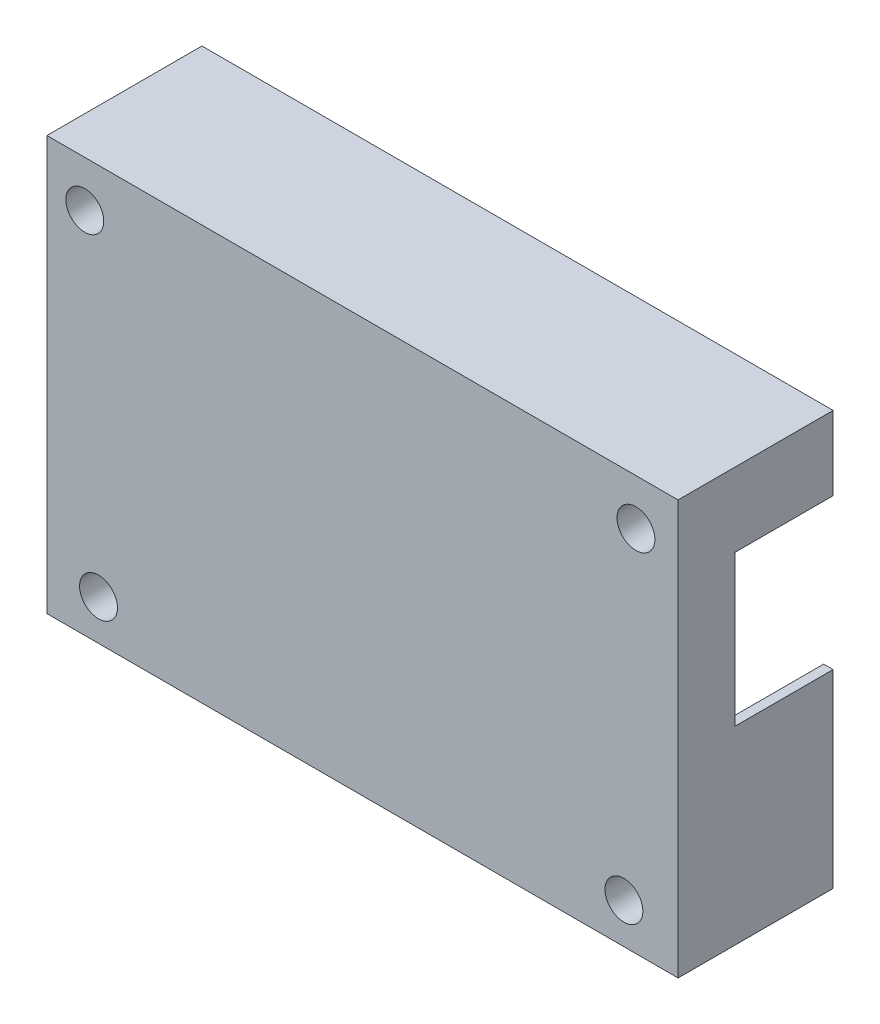
ISO-10303-21;
HEADER;
FILE_DESCRIPTION(('STEP AP214'),'2;1');
FILE_NAME('part.step','',(''),(''),'','','');
FILE_SCHEMA(('AUTOMOTIVE_DESIGN { 1 0 10303 214 1 1 1 1 }'));
ENDSEC;
DATA;
#1=APPLICATION_CONTEXT('core data for automotive mechanical design processes');
#2=APPLICATION_PROTOCOL_DEFINITION('international standard','automotive_design',2000,#1);
#3=PRODUCT_CONTEXT('',#1,'mechanical');
#4=PRODUCT('Part','Part','',(#3));
#5=PRODUCT_RELATED_PRODUCT_CATEGORY('part','',(#4));
#6=PRODUCT_DEFINITION_FORMATION('','',#4);
#7=PRODUCT_DEFINITION_CONTEXT('part definition',#1,'design');
#8=PRODUCT_DEFINITION('design','',#6,#7);
#9=PRODUCT_DEFINITION_SHAPE('','',#8);
#10=(LENGTH_UNIT() NAMED_UNIT(*) SI_UNIT(.MILLI.,.METRE.));
#11=(NAMED_UNIT(*) PLANE_ANGLE_UNIT() SI_UNIT($,.RADIAN.));
#12=(NAMED_UNIT(*) SI_UNIT($,.STERADIAN.) SOLID_ANGLE_UNIT());
#13=UNCERTAINTY_MEASURE_WITH_UNIT(LENGTH_MEASURE(1.E-05),#10,'distance_accuracy_value','');
#14=(GEOMETRIC_REPRESENTATION_CONTEXT(3) GLOBAL_UNCERTAINTY_ASSIGNED_CONTEXT((#13)) GLOBAL_UNIT_ASSIGNED_CONTEXT((#10,
#11,#12)) REPRESENTATION_CONTEXT('',''));
#15=CARTESIAN_POINT('',(0.,0.,0.));
#16=DIRECTION('',(0.,0.,1.));
#17=DIRECTION('',(1.,0.,0.));
#18=AXIS2_PLACEMENT_3D('',#15,#16,#17);
#19=CARTESIAN_POINT('',(0.,0.,8.25));
#20=DIRECTION('',(0.,0.,1.));
#21=DIRECTION('',(1.,0.,0.));
#22=AXIS2_PLACEMENT_3D('',#19,#20,#21);
#23=PLANE('',#22);
#24=DIRECTION('',(1.,0.,0.));
#25=VECTOR('',#24,1.);
#26=CARTESIAN_POINT('',(0.,-1.84,8.25000000000001));
#27=LINE('',#26,#25);
#28=CARTESIAN_POINT('',(-33.325,-1.84,8.25000000000001));
#29=VERTEX_POINT('',#28);
#30=CARTESIAN_POINT('',(-32.325,-1.84,8.25000000000001));
#31=VERTEX_POINT('',#30);
#32=EDGE_CURVE('E597',#29,#31,#27,.T.);
#33=ORIENTED_EDGE('',*,*,#32,.F.);
#34=DIRECTION('',(0.,-1.,0.));
#35=VECTOR('',#34,1.);
#36=CARTESIAN_POINT('',(-33.325,0.,8.25));
#37=LINE('',#36,#35);
#38=CARTESIAN_POINT('',(-33.325,14.06,8.25000000000001));
#39=VERTEX_POINT('',#38);
#40=EDGE_CURVE('E650',#39,#29,#37,.T.);
#41=ORIENTED_EDGE('',*,*,#40,.F.);
#42=DIRECTION('',(-1.,0.,0.));
#43=VECTOR('',#42,1.);
#44=CARTESIAN_POINT('',(0.,14.06,8.25000000000001));
#45=LINE('',#44,#43);
#46=CARTESIAN_POINT('',(-32.325,14.06,8.25));
#47=VERTEX_POINT('',#46);
#48=EDGE_CURVE('E736',#47,#39,#45,.T.);
#49=ORIENTED_EDGE('',*,*,#48,.F.);
#50=DIRECTION('',(0.,-1.,0.));
#51=VECTOR('',#50,1.);
#52=CARTESIAN_POINT('',(-32.325,0.,8.25));
#53=LINE('',#52,#51);
#54=EDGE_CURVE('E615',#47,#31,#53,.T.);
#55=ORIENTED_EDGE('',*,*,#54,.T.);
#56=EDGE_LOOP('',(#33,#41,#49,#55));
#57=FACE_BOUND('',#56,.T.);
#58=ADVANCED_FACE('F303',(#57),#23,.F.);
#59=DIRECTION('',(1.,0.,0.));
#60=VECTOR('',#59,1.);
#61=CARTESIAN_POINT('',(0.,-1.84,8.25000000000001));
#62=LINE('',#61,#60);
#63=CARTESIAN_POINT('',(32.325,-1.84,8.25000000000001));
#64=VERTEX_POINT('',#63);
#65=CARTESIAN_POINT('',(33.325,-1.84,8.25000000000001));
#66=VERTEX_POINT('',#65);
#67=EDGE_CURVE('E603',#64,#66,#62,.T.);
#68=ORIENTED_EDGE('',*,*,#67,.F.);
#69=DIRECTION('',(0.,-1.,0.));
#70=VECTOR('',#69,1.);
#71=CARTESIAN_POINT('',(32.325,0.,8.25));
#72=LINE('',#71,#70);
#73=CARTESIAN_POINT('',(32.325,14.06,8.25));
#74=VERTEX_POINT('',#73);
#75=EDGE_CURVE('E642',#74,#64,#72,.T.);
#76=ORIENTED_EDGE('',*,*,#75,.F.);
#77=DIRECTION('',(-1.,0.,0.));
#78=VECTOR('',#77,1.);
#79=CARTESIAN_POINT('',(0.,14.0600000000002,8.25000000000001));
#80=LINE('',#79,#78);
#81=CARTESIAN_POINT('',(33.325,14.06,8.25));
#82=VERTEX_POINT('',#81);
#83=EDGE_CURVE('E727',#82,#74,#80,.T.);
#84=ORIENTED_EDGE('',*,*,#83,.F.);
#85=DIRECTION('',(0.,1.,0.));
#86=VECTOR('',#85,1.);
#87=CARTESIAN_POINT('',(33.325,0.,8.25));
#88=LINE('',#87,#86);
#89=EDGE_CURVE('E522',#66,#82,#88,.T.);
#90=ORIENTED_EDGE('',*,*,#89,.F.);
#91=EDGE_LOOP('',(#68,#76,#84,#90));
#92=FACE_BOUND('',#91,.T.);
#93=ADVANCED_FACE('F835',(#92),#23,.F.);
#94=CARTESIAN_POINT('',(0.,0.,0.));
#95=DIRECTION('',(0.,0.,1.));
#96=DIRECTION('',(1.,0.,0.));
#97=AXIS2_PLACEMENT_3D('',#94,#95,#96);
#98=PLANE('',#97);
#99=CARTESIAN_POINT('',(-29.325,17.01,0.));
#100=DIRECTION('',(0.,0.,1.));
#101=DIRECTION('',(1.,0.,0.));
#102=AXIS2_PLACEMENT_3D('',#99,#100,#101);
#103=CIRCLE('',#102,2.);
#104=CARTESIAN_POINT('',(-27.325,17.01,0.));
#105=VERTEX_POINT('',#104);
#106=EDGE_CURVE('E714',#105,#105,#103,.T.);
#107=ORIENTED_EDGE('',*,*,#106,.T.);
#108=EDGE_LOOP('',(#107));
#109=FACE_BOUND('',#108,.T.);
#110=DIRECTION('',(0.,1.,0.));
#111=VECTOR('',#110,1.);
#112=CARTESIAN_POINT('',(-26.325,0.,0.));
#113=LINE('',#112,#111);
#114=CARTESIAN_POINT('',(-26.325,15.06,0.));
#115=VERTEX_POINT('',#114);
#116=CARTESIAN_POINT('',(-26.325,20.86,0.));
#117=VERTEX_POINT('',#116);
#118=EDGE_CURVE('E718',#115,#117,#113,.T.);
#119=ORIENTED_EDGE('',*,*,#118,.F.);
#120=CARTESIAN_POINT('',(-27.325,15.06,0.));
#121=DIRECTION('',(0.,0.,1.));
#122=DIRECTION('',(1.,0.,0.));
#123=AXIS2_PLACEMENT_3D('',#120,#121,#122);
#124=CIRCLE('',#123,1.);
#125=CARTESIAN_POINT('',(-27.325,14.06,0.));
#126=VERTEX_POINT('',#125);
#127=EDGE_CURVE('E761',#115,#126,#124,.F.);
#128=ORIENTED_EDGE('',*,*,#127,.T.);
#129=DIRECTION('',(1.,0.,0.));
#130=VECTOR('',#129,1.);
#131=CARTESIAN_POINT('',(0.,14.06,0.));
#132=LINE('',#131,#130);
#133=CARTESIAN_POINT('',(-32.325,14.06,0.));
#134=VERTEX_POINT('',#133);
#135=EDGE_CURVE('E720',#134,#126,#132,.T.);
#136=ORIENTED_EDGE('',*,*,#135,.F.);
#137=DIRECTION('',(0.,-1.,0.));
#138=VECTOR('',#137,1.);
#139=CARTESIAN_POINT('',(-32.325,0.,0.));
#140=LINE('',#139,#138);
#141=CARTESIAN_POINT('',(-32.325,20.86,0.));
#142=VERTEX_POINT('',#141);
#143=EDGE_CURVE('E679',#142,#134,#140,.T.);
#144=ORIENTED_EDGE('',*,*,#143,.F.);
#145=DIRECTION('',(-1.,0.,0.));
#146=VECTOR('',#145,1.);
#147=CARTESIAN_POINT('',(0.,20.86,0.));
#148=LINE('',#147,#146);
#149=EDGE_CURVE('E678',#117,#142,#148,.T.);
#150=ORIENTED_EDGE('',*,*,#149,.F.);
#151=EDGE_LOOP('',(#119,#128,#136,#144,#150));
#152=FACE_BOUND('',#151,.T.);
#153=ADVANCED_FACE('F788',(#109,#152),#98,.F.);
#154=CARTESIAN_POINT('',(28.875,17.01,0.));
#155=DIRECTION('',(0.,0.,1.));
#156=DIRECTION('',(1.,0.,0.));
#157=AXIS2_PLACEMENT_3D('',#154,#155,#156);
#158=CIRCLE('',#157,2.);
#159=CARTESIAN_POINT('',(30.875,17.01,0.));
#160=VERTEX_POINT('',#159);
#161=EDGE_CURVE('E711',#160,#160,#158,.T.);
#162=ORIENTED_EDGE('',*,*,#161,.T.);
#163=EDGE_LOOP('',(#162));
#164=FACE_BOUND('',#163,.T.);
#165=DIRECTION('',(1.,0.,0.));
#166=VECTOR('',#165,1.);
#167=CARTESIAN_POINT('',(0.,14.0600000000002,0.));
#168=LINE('',#167,#166);
#169=CARTESIAN_POINT('',(26.825,14.06,0.));
#170=VERTEX_POINT('',#169);
#171=CARTESIAN_POINT('',(32.325,14.06,0.));
#172=VERTEX_POINT('',#171);
#173=EDGE_CURVE('E724',#170,#172,#168,.T.);
#174=ORIENTED_EDGE('',*,*,#173,.F.);
#175=CARTESIAN_POINT('',(26.825,15.06,0.));
#176=DIRECTION('',(0.,0.,1.));
#177=DIRECTION('',(1.,0.,0.));
#178=AXIS2_PLACEMENT_3D('',#175,#176,#177);
#179=CIRCLE('',#178,1.);
#180=CARTESIAN_POINT('',(25.825,15.06,0.));
#181=VERTEX_POINT('',#180);
#182=EDGE_CURVE('E754',#170,#181,#179,.F.);
#183=ORIENTED_EDGE('',*,*,#182,.T.);
#184=DIRECTION('',(0.,1.,0.));
#185=VECTOR('',#184,1.);
#186=CARTESIAN_POINT('',(25.825,0.,0.));
#187=LINE('',#186,#185);
#188=CARTESIAN_POINT('',(25.825,20.86,0.));
#189=VERTEX_POINT('',#188);
#190=EDGE_CURVE('E717',#181,#189,#187,.T.);
#191=ORIENTED_EDGE('',*,*,#190,.T.);
#192=CARTESIAN_POINT('',(32.325,20.86,0.));
#193=VERTEX_POINT('',#192);
#194=EDGE_CURVE('E674',#193,#189,#148,.T.);
#195=ORIENTED_EDGE('',*,*,#194,.F.);
#196=DIRECTION('',(0.,1.,0.));
#197=VECTOR('',#196,1.);
#198=CARTESIAN_POINT('',(32.325,0.,0.));
#199=LINE('',#198,#197);
#200=EDGE_CURVE('E669',#172,#193,#199,.T.);
#201=ORIENTED_EDGE('',*,*,#200,.F.);
#202=EDGE_LOOP('',(#174,#183,#191,#195,#201));
#203=FACE_BOUND('',#202,.T.);
#204=ADVANCED_FACE('F818',(#164,#203),#98,.F.);
#205=CARTESIAN_POINT('',(0.,20.86,77.841830698725));
#206=DIRECTION('',(0.,-1.,0.));
#207=DIRECTION('',(0.,0.,-1.));
#208=AXIS2_PLACEMENT_3D('',#205,#206,#207);
#209=PLANE('',#208);
#210=DIRECTION('',(0.,0.,-1.));
#211=VECTOR('',#210,1.);
#212=CARTESIAN_POINT('',(25.825,20.86,77.841830698725));
#213=LINE('',#212,#211);
#214=CARTESIAN_POINT('',(25.825,20.86,13.25));
#215=VERTEX_POINT('',#214);
#216=EDGE_CURVE('E729',#215,#189,#213,.T.);
#217=ORIENTED_EDGE('',*,*,#216,.F.);
#218=DIRECTION('',(-1.,0.,0.));
#219=VECTOR('',#218,1.);
#220=CARTESIAN_POINT('',(0.,20.86,13.25));
#221=LINE('',#220,#219);
#222=CARTESIAN_POINT('',(-26.325,20.86,13.25));
#223=VERTEX_POINT('',#222);
#224=EDGE_CURVE('E617',#215,#223,#221,.T.);
#225=ORIENTED_EDGE('',*,*,#224,.T.);
#226=DIRECTION('',(0.,0.,-1.));
#227=VECTOR('',#226,1.);
#228=CARTESIAN_POINT('',(-26.325,20.86,77.841830698725));
#229=LINE('',#228,#227);
#230=EDGE_CURVE('E691',#223,#117,#229,.T.);
#231=ORIENTED_EDGE('',*,*,#230,.T.);
#232=ORIENTED_EDGE('',*,*,#149,.T.);
#233=DIRECTION('',(0.,0.,1.));
#234=VECTOR('',#233,1.);
#235=CARTESIAN_POINT('',(-32.325,20.86,-72.211830698725));
#236=LINE('',#235,#234);
#237=CARTESIAN_POINT('',(-32.325,20.86,-2.12));
#238=VERTEX_POINT('',#237);
#239=EDGE_CURVE('E682',#238,#142,#236,.T.);
#240=ORIENTED_EDGE('',*,*,#239,.F.);
#241=DIRECTION('',(-1.,0.,0.));
#242=VECTOR('',#241,1.);
#243=CARTESIAN_POINT('',(0.,20.86,-2.12));
#244=LINE('',#243,#242);
#245=CARTESIAN_POINT('',(32.325,20.86,-2.12));
#246=VERTEX_POINT('',#245);
#247=EDGE_CURVE('E700',#246,#238,#244,.T.);
#248=ORIENTED_EDGE('',*,*,#247,.F.);
#249=DIRECTION('',(0.,0.,1.));
#250=VECTOR('',#249,1.);
#251=CARTESIAN_POINT('',(32.325,20.86,-72.211830698725));
#252=LINE('',#251,#250);
#253=EDGE_CURVE('E677',#246,#193,#252,.T.);
#254=ORIENTED_EDGE('',*,*,#253,.T.);
#255=ORIENTED_EDGE('',*,*,#194,.T.);
#256=EDGE_LOOP('',(#217,#225,#231,#232,#240,#248,#254,#255));
#257=FACE_BOUND('',#256,.T.);
#258=ADVANCED_FACE('F801',(#257),#209,.T.);
#259=CARTESIAN_POINT('',(25.825,0.,77.841830698725));
#260=DIRECTION('',(-1.,0.,0.));
#261=DIRECTION('',(0.,0.,1.));
#262=AXIS2_PLACEMENT_3D('',#259,#260,#261);
#263=PLANE('',#262);
#264=ORIENTED_EDGE('',*,*,#190,.F.);
#265=DIRECTION('',(0.,0.,-1.));
#266=VECTOR('',#265,1.);
#267=CARTESIAN_POINT('',(25.825,15.06,13.25));
#268=LINE('',#267,#266);
#269=CARTESIAN_POINT('',(25.825,15.06,13.25));
#270=VERTEX_POINT('',#269);
#271=EDGE_CURVE('E756',#181,#270,#268,.F.);
#272=ORIENTED_EDGE('',*,*,#271,.T.);
#273=DIRECTION('',(0.,1.,0.));
#274=VECTOR('',#273,1.);
#275=CARTESIAN_POINT('',(25.825,0.,13.25));
#276=LINE('',#275,#274);
#277=EDGE_CURVE('E620',#270,#215,#276,.T.);
#278=ORIENTED_EDGE('',*,*,#277,.T.);
#279=ORIENTED_EDGE('',*,*,#216,.T.);
#280=EDGE_LOOP('',(#264,#272,#278,#279));
#281=FACE_BOUND('',#280,.T.);
#282=ADVANCED_FACE('F922',(#281),#263,.T.);
#283=CARTESIAN_POINT('',(0.,14.0600000000002,77.841830698725));
#284=DIRECTION('',(0.,1.,0.));
#285=DIRECTION('',(-1.,0.,0.));
#286=AXIS2_PLACEMENT_3D('',#283,#284,#285);
#287=PLANE('',#286);
#288=DIRECTION('',(1.,0.,0.));
#289=VECTOR('',#288,1.);
#290=CARTESIAN_POINT('',(0.,14.06,13.25));
#291=LINE('',#290,#289);
#292=CARTESIAN_POINT('',(26.825,14.06,13.25));
#293=VERTEX_POINT('',#292);
#294=CARTESIAN_POINT('',(32.325,14.06,13.25));
#295=VERTEX_POINT('',#294);
#296=EDGE_CURVE('E622',#293,#295,#291,.T.);
#297=ORIENTED_EDGE('',*,*,#296,.F.);
#298=DIRECTION('',(0.,0.,-1.));
#299=VECTOR('',#298,1.);
#300=CARTESIAN_POINT('',(26.825,14.06,0.));
#301=LINE('',#300,#299);
#302=EDGE_CURVE('E751',#293,#170,#301,.T.);
#303=ORIENTED_EDGE('',*,*,#302,.T.);
#304=ORIENTED_EDGE('',*,*,#173,.T.);
#305=DIRECTION('',(0.,0.,1.));
#306=VECTOR('',#305,1.);
#307=CARTESIAN_POINT('',(32.325,14.06,-72.211830698725));
#308=LINE('',#307,#306);
#309=CARTESIAN_POINT('',(32.325,14.06,-2.12));
#310=VERTEX_POINT('',#309);
#311=EDGE_CURVE('E673',#310,#172,#308,.T.);
#312=ORIENTED_EDGE('',*,*,#311,.F.);
#313=DIRECTION('',(1.,0.,0.));
#314=VECTOR('',#313,1.);
#315=CARTESIAN_POINT('',(0.,14.0600000000002,-2.12));
#316=LINE('',#315,#314);
#317=CARTESIAN_POINT('',(33.325,14.06,-2.12));
#318=VERTEX_POINT('',#317);
#319=EDGE_CURVE('E672',#310,#318,#316,.T.);
#320=ORIENTED_EDGE('',*,*,#319,.T.);
#321=DIRECTION('',(0.,0.,-1.));
#322=VECTOR('',#321,1.);
#323=CARTESIAN_POINT('',(33.325,14.06,77.841830698725));
#324=LINE('',#323,#322);
#325=EDGE_CURVE('E726',#82,#318,#324,.T.);
#326=ORIENTED_EDGE('',*,*,#325,.F.);
#327=ORIENTED_EDGE('',*,*,#83,.T.);
#328=DIRECTION('',(0.,0.,-1.));
#329=VECTOR('',#328,1.);
#330=CARTESIAN_POINT('',(32.325,14.06,13.25));
#331=LINE('',#330,#329);
#332=EDGE_CURVE('E641',#295,#74,#331,.T.);
#333=ORIENTED_EDGE('',*,*,#332,.F.);
#334=EDGE_LOOP('',(#297,#303,#304,#312,#320,#326,#327,#333));
#335=FACE_BOUND('',#334,.T.);
#336=ADVANCED_FACE('F813',(#335),#287,.F.);
#337=CARTESIAN_POINT('',(33.325,0.,77.841830698725));
#338=DIRECTION('',(-1.,0.,0.));
#339=DIRECTION('',(0.,0.,1.));
#340=AXIS2_PLACEMENT_3D('',#337,#338,#339);
#341=PLANE('',#340);
#342=DIRECTION('',(0.,0.,-1.));
#343=VECTOR('',#342,1.);
#344=CARTESIAN_POINT('',(33.325,21.86,77.841830698725));
#345=LINE('',#344,#343);
#346=CARTESIAN_POINT('',(33.325,21.86,14.25));
#347=VERTEX_POINT('',#346);
#348=CARTESIAN_POINT('',(33.325,21.86,-2.12));
#349=VERTEX_POINT('',#348);
#350=EDGE_CURVE('E528',#347,#349,#345,.T.);
#351=ORIENTED_EDGE('',*,*,#350,.F.);
#352=DIRECTION('',(0.,1.,0.));
#353=VECTOR('',#352,1.);
#354=CARTESIAN_POINT('',(33.325,-21.86,14.25));
#355=LINE('',#354,#353);
#356=CARTESIAN_POINT('',(33.325,-21.86,14.25));
#357=VERTEX_POINT('',#356);
#358=EDGE_CURVE('E525',#357,#347,#355,.T.);
#359=ORIENTED_EDGE('',*,*,#358,.F.);
#360=DIRECTION('',(0.,0.,-1.));
#361=VECTOR('',#360,1.);
#362=CARTESIAN_POINT('',(33.325,-21.86,13.25));
#363=LINE('',#362,#361);
#364=CARTESIAN_POINT('',(33.325,-21.86,-2.12));
#365=VERTEX_POINT('',#364);
#366=EDGE_CURVE('E511',#357,#365,#363,.T.);
#367=ORIENTED_EDGE('',*,*,#366,.T.);
#368=DIRECTION('',(0.,1.,0.));
#369=VECTOR('',#368,1.);
#370=CARTESIAN_POINT('',(33.325,0.,-2.12));
#371=LINE('',#370,#369);
#372=CARTESIAN_POINT('',(33.325,-1.84,-2.12));
#373=VERTEX_POINT('',#372);
#374=EDGE_CURVE('E567',#365,#373,#371,.T.);
#375=ORIENTED_EDGE('',*,*,#374,.T.);
#376=DIRECTION('',(0.,0.,-1.));
#377=VECTOR('',#376,1.);
#378=CARTESIAN_POINT('',(33.325,-1.84,77.841830698725));
#379=LINE('',#378,#377);
#380=EDGE_CURVE('E604',#66,#373,#379,.T.);
#381=ORIENTED_EDGE('',*,*,#380,.F.);
#382=ORIENTED_EDGE('',*,*,#89,.T.);
#383=ORIENTED_EDGE('',*,*,#325,.T.);
#384=DIRECTION('',(0.,1.,0.));
#385=VECTOR('',#384,1.);
#386=CARTESIAN_POINT('',(33.325,0.,-2.12));
#387=LINE('',#386,#385);
#388=EDGE_CURVE('E695',#318,#349,#387,.T.);
#389=ORIENTED_EDGE('',*,*,#388,.T.);
#390=EDGE_LOOP('',(#351,#359,#367,#375,#381,#382,#383,#389));
#391=FACE_BOUND('',#390,.T.);
#392=ADVANCED_FACE('F526',(#391),#341,.F.);
#393=CARTESIAN_POINT('',(0.,21.86,77.841830698725));
#394=DIRECTION('',(0.,-1.,0.));
#395=DIRECTION('',(1.,0.,0.));
#396=AXIS2_PLACEMENT_3D('',#393,#394,#395);
#397=PLANE('',#396);
#398=DIRECTION('',(0.,0.,-1.));
#399=VECTOR('',#398,1.);
#400=CARTESIAN_POINT('',(-33.325,21.86,77.841830698725));
#401=LINE('',#400,#399);
#402=CARTESIAN_POINT('',(-33.325,21.86,14.25));
#403=VERTEX_POINT('',#402);
#404=CARTESIAN_POINT('',(-33.325,21.86,-2.12));
#405=VERTEX_POINT('',#404);
#406=EDGE_CURVE('E734',#403,#405,#401,.T.);
#407=ORIENTED_EDGE('',*,*,#406,.F.);
#408=DIRECTION('',(-1.,0.,0.));
#409=VECTOR('',#408,1.);
#410=CARTESIAN_POINT('',(33.325,21.86,14.25));
#411=LINE('',#410,#409);
#412=EDGE_CURVE('E532',#347,#403,#411,.T.);
#413=ORIENTED_EDGE('',*,*,#412,.F.);
#414=ORIENTED_EDGE('',*,*,#350,.T.);
#415=DIRECTION('',(-1.,0.,0.));
#416=VECTOR('',#415,1.);
#417=CARTESIAN_POINT('',(0.,21.86,-2.12));
#418=LINE('',#417,#416);
#419=EDGE_CURVE('E692',#349,#405,#418,.T.);
#420=ORIENTED_EDGE('',*,*,#419,.T.);
#421=EDGE_LOOP('',(#407,#413,#414,#420));
#422=FACE_BOUND('',#421,.T.);
#423=ADVANCED_FACE('F913',(#422),#397,.F.);
#424=CARTESIAN_POINT('',(-33.325,0.,77.841830698725));
#425=DIRECTION('',(1.,0.,0.));
#426=DIRECTION('',(0.,0.,-1.));
#427=AXIS2_PLACEMENT_3D('',#424,#425,#426);
#428=PLANE('',#427);
#429=DIRECTION('',(0.,0.,-1.));
#430=VECTOR('',#429,1.);
#431=CARTESIAN_POINT('',(-33.325,14.06,77.841830698725));
#432=LINE('',#431,#430);
#433=CARTESIAN_POINT('',(-33.325,14.06,-2.12));
#434=VERTEX_POINT('',#433);
#435=EDGE_CURVE('E723',#39,#434,#432,.T.);
#436=ORIENTED_EDGE('',*,*,#435,.F.);
#437=ORIENTED_EDGE('',*,*,#40,.T.);
#438=DIRECTION('',(0.,0.,-1.));
#439=VECTOR('',#438,1.);
#440=CARTESIAN_POINT('',(-33.325,-1.84,77.841830698725));
#441=LINE('',#440,#439);
#442=CARTESIAN_POINT('',(-33.325,-1.84,-2.12));
#443=VERTEX_POINT('',#442);
#444=EDGE_CURVE('E601',#29,#443,#441,.T.);
#445=ORIENTED_EDGE('',*,*,#444,.T.);
#446=DIRECTION('',(0.,-1.,0.));
#447=VECTOR('',#446,1.);
#448=CARTESIAN_POINT('',(-33.325,0.,-2.12));
#449=LINE('',#448,#447);
#450=CARTESIAN_POINT('',(-33.325,-21.86,-2.12));
#451=VERTEX_POINT('',#450);
#452=EDGE_CURVE('E571',#443,#451,#449,.T.);
#453=ORIENTED_EDGE('',*,*,#452,.T.);
#454=DIRECTION('',(0.,0.,-1.));
#455=VECTOR('',#454,1.);
#456=CARTESIAN_POINT('',(-33.325,-21.86,13.25));
#457=LINE('',#456,#455);
#458=CARTESIAN_POINT('',(-33.325,-21.86,14.25));
#459=VERTEX_POINT('',#458);
#460=EDGE_CURVE('E521',#459,#451,#457,.T.);
#461=ORIENTED_EDGE('',*,*,#460,.F.);
#462=DIRECTION('',(0.,-1.,0.));
#463=VECTOR('',#462,1.);
#464=CARTESIAN_POINT('',(-33.325,21.86,14.25));
#465=LINE('',#464,#463);
#466=EDGE_CURVE('E538',#403,#459,#465,.T.);
#467=ORIENTED_EDGE('',*,*,#466,.F.);
#468=ORIENTED_EDGE('',*,*,#406,.T.);
#469=DIRECTION('',(0.,-1.,0.));
#470=VECTOR('',#469,1.);
#471=CARTESIAN_POINT('',(-33.325,0.,-2.12));
#472=LINE('',#471,#470);
#473=EDGE_CURVE('E688',#405,#434,#472,.T.);
#474=ORIENTED_EDGE('',*,*,#473,.T.);
#475=EDGE_LOOP('',(#436,#437,#445,#453,#461,#467,#468,#474));
#476=FACE_BOUND('',#475,.T.);
#477=ADVANCED_FACE('F910',(#476),#428,.F.);
#478=CARTESIAN_POINT('',(0.,14.06,77.841830698725));
#479=DIRECTION('',(0.,1.,0.));
#480=DIRECTION('',(0.,0.,1.));
#481=AXIS2_PLACEMENT_3D('',#478,#479,#480);
#482=PLANE('',#481);
#483=ORIENTED_EDGE('',*,*,#135,.T.);
#484=DIRECTION('',(0.,0.,-1.));
#485=VECTOR('',#484,1.);
#486=CARTESIAN_POINT('',(-27.325,14.06,77.841830698725));
#487=LINE('',#486,#485);
#488=CARTESIAN_POINT('',(-27.325,14.06,13.25));
#489=VERTEX_POINT('',#488);
#490=EDGE_CURVE('E763',#126,#489,#487,.F.);
#491=ORIENTED_EDGE('',*,*,#490,.T.);
#492=DIRECTION('',(1.,0.,0.));
#493=VECTOR('',#492,1.);
#494=CARTESIAN_POINT('',(0.,14.06,13.25));
#495=LINE('',#494,#493);
#496=CARTESIAN_POINT('',(-32.325,14.06,13.25));
#497=VERTEX_POINT('',#496);
#498=EDGE_CURVE('E611',#497,#489,#495,.T.);
#499=ORIENTED_EDGE('',*,*,#498,.F.);
#500=DIRECTION('',(0.,0.,-1.));
#501=VECTOR('',#500,1.);
#502=CARTESIAN_POINT('',(-32.325,14.06,13.25));
#503=LINE('',#502,#501);
#504=EDGE_CURVE('E647',#497,#47,#503,.T.);
#505=ORIENTED_EDGE('',*,*,#504,.T.);
#506=ORIENTED_EDGE('',*,*,#48,.T.);
#507=ORIENTED_EDGE('',*,*,#435,.T.);
#508=DIRECTION('',(1.,0.,0.));
#509=VECTOR('',#508,1.);
#510=CARTESIAN_POINT('',(0.,14.06,-2.12));
#511=LINE('',#510,#509);
#512=CARTESIAN_POINT('',(-32.325,14.06,-2.12));
#513=VERTEX_POINT('',#512);
#514=EDGE_CURVE('E683',#434,#513,#511,.T.);
#515=ORIENTED_EDGE('',*,*,#514,.T.);
#516=DIRECTION('',(0.,0.,1.));
#517=VECTOR('',#516,1.);
#518=CARTESIAN_POINT('',(-32.325,14.06,-72.211830698725));
#519=LINE('',#518,#517);
#520=EDGE_CURVE('E686',#513,#134,#519,.T.);
#521=ORIENTED_EDGE('',*,*,#520,.T.);
#522=EDGE_LOOP('',(#483,#491,#499,#505,#506,#507,#515,#521));
#523=FACE_BOUND('',#522,.T.);
#524=ADVANCED_FACE('F791',(#523),#482,.F.);
#525=CARTESIAN_POINT('',(-29.325,17.01,77.841830698725));
#526=DIRECTION('',(0.,0.,-1.));
#527=DIRECTION('',(-1.,0.,0.));
#528=AXIS2_PLACEMENT_3D('',#525,#526,#527);
#529=CYLINDRICAL_SURFACE('',#528,2.);
#530=ORIENTED_EDGE('',*,*,#106,.F.);
#531=EDGE_LOOP('',(#530));
#532=FACE_BOUND('',#531,.T.);
#533=CARTESIAN_POINT('',(-29.325,17.01,14.25));
#534=DIRECTION('',(0.,0.,1.));
#535=DIRECTION('',(1.,0.,0.));
#536=AXIS2_PLACEMENT_3D('',#533,#534,#535);
#537=CIRCLE('',#536,2.);
#538=CARTESIAN_POINT('',(-27.325,17.01,14.25));
#539=VERTEX_POINT('',#538);
#540=EDGE_CURVE('E1564',#539,#539,#537,.T.);
#541=ORIENTED_EDGE('',*,*,#540,.T.);
#542=EDGE_LOOP('',(#541));
#543=FACE_BOUND('',#542,.T.);
#544=ADVANCED_FACE('F902',(#532,#543),#529,.F.);
#545=CARTESIAN_POINT('',(-26.325,0.,77.841830698725));
#546=DIRECTION('',(-1.,0.,0.));
#547=DIRECTION('',(0.,0.,1.));
#548=AXIS2_PLACEMENT_3D('',#545,#546,#547);
#549=PLANE('',#548);
#550=DIRECTION('',(0.,1.,0.));
#551=VECTOR('',#550,1.);
#552=CARTESIAN_POINT('',(-26.325,0.,13.25));
#553=LINE('',#552,#551);
#554=CARTESIAN_POINT('',(-26.325,15.06,13.25));
#555=VERTEX_POINT('',#554);
#556=EDGE_CURVE('E614',#555,#223,#553,.T.);
#557=ORIENTED_EDGE('',*,*,#556,.F.);
#558=DIRECTION('',(0.,0.,-1.));
#559=VECTOR('',#558,1.);
#560=CARTESIAN_POINT('',(-26.325,15.06,77.841830698725));
#561=LINE('',#560,#559);
#562=EDGE_CURVE('E758',#555,#115,#561,.T.);
#563=ORIENTED_EDGE('',*,*,#562,.T.);
#564=ORIENTED_EDGE('',*,*,#118,.T.);
#565=ORIENTED_EDGE('',*,*,#230,.F.);
#566=EDGE_LOOP('',(#557,#563,#564,#565));
#567=FACE_BOUND('',#566,.T.);
#568=ADVANCED_FACE('F784',(#567),#549,.F.);
#569=CARTESIAN_POINT('',(28.875,17.01,77.841830698725));
#570=DIRECTION('',(0.,0.,-1.));
#571=DIRECTION('',(-1.,0.,0.));
#572=AXIS2_PLACEMENT_3D('',#569,#570,#571);
#573=CYLINDRICAL_SURFACE('',#572,2.);
#574=ORIENTED_EDGE('',*,*,#161,.F.);
#575=EDGE_LOOP('',(#574));
#576=FACE_BOUND('',#575,.T.);
#577=CARTESIAN_POINT('',(28.875,17.01,14.25));
#578=DIRECTION('',(0.,0.,1.));
#579=DIRECTION('',(1.,0.,0.));
#580=AXIS2_PLACEMENT_3D('',#577,#578,#579);
#581=CIRCLE('',#580,2.);
#582=CARTESIAN_POINT('',(30.875,17.01,14.25));
#583=VERTEX_POINT('',#582);
#584=EDGE_CURVE('E542',#583,#583,#581,.T.);
#585=ORIENTED_EDGE('',*,*,#584,.T.);
#586=EDGE_LOOP('',(#585));
#587=FACE_BOUND('',#586,.T.);
#588=ADVANCED_FACE('F898',(#576,#587),#573,.F.);
#589=CARTESIAN_POINT('',(0.,0.,-2.12));
#590=DIRECTION('',(0.,0.,-1.));
#591=DIRECTION('',(0.,1.,0.));
#592=AXIS2_PLACEMENT_3D('',#589,#590,#591);
#593=PLANE('',#592);
#594=ORIENTED_EDGE('',*,*,#473,.F.);
#595=ORIENTED_EDGE('',*,*,#419,.F.);
#596=ORIENTED_EDGE('',*,*,#388,.F.);
#597=ORIENTED_EDGE('',*,*,#319,.F.);
#598=DIRECTION('',(0.,1.,0.));
#599=VECTOR('',#598,1.);
#600=CARTESIAN_POINT('',(32.325,0.,-2.12));
#601=LINE('',#600,#599);
#602=EDGE_CURVE('E668',#310,#246,#601,.T.);
#603=ORIENTED_EDGE('',*,*,#602,.T.);
#604=ORIENTED_EDGE('',*,*,#247,.T.);
#605=DIRECTION('',(0.,-1.,0.));
#606=VECTOR('',#605,1.);
#607=CARTESIAN_POINT('',(-32.325,0.,-2.12));
#608=LINE('',#607,#606);
#609=EDGE_CURVE('E687',#238,#513,#608,.T.);
#610=ORIENTED_EDGE('',*,*,#609,.T.);
#611=ORIENTED_EDGE('',*,*,#514,.F.);
#612=EDGE_LOOP('',(#594,#595,#596,#597,#603,#604,#610,#611));
#613=FACE_BOUND('',#612,.T.);
#614=ADVANCED_FACE('F828',(#613),#593,.T.);
#615=CARTESIAN_POINT('',(-32.325,0.,-72.211830698725));
#616=DIRECTION('',(-1.,0.,0.));
#617=DIRECTION('',(0.,0.,1.));
#618=AXIS2_PLACEMENT_3D('',#615,#616,#617);
#619=PLANE('',#618);
#620=ORIENTED_EDGE('',*,*,#609,.F.);
#621=ORIENTED_EDGE('',*,*,#239,.T.);
#622=ORIENTED_EDGE('',*,*,#143,.T.);
#623=ORIENTED_EDGE('',*,*,#520,.F.);
#624=EDGE_LOOP('',(#620,#621,#622,#623));
#625=FACE_BOUND('',#624,.T.);
#626=ADVANCED_FACE('F796',(#625),#619,.F.);
#627=CARTESIAN_POINT('',(32.325,0.,-72.211830698725));
#628=DIRECTION('',(1.,0.,0.));
#629=DIRECTION('',(0.,0.,-1.));
#630=AXIS2_PLACEMENT_3D('',#627,#628,#629);
#631=PLANE('',#630);
#632=ORIENTED_EDGE('',*,*,#602,.F.);
#633=ORIENTED_EDGE('',*,*,#311,.T.);
#634=ORIENTED_EDGE('',*,*,#200,.T.);
#635=ORIENTED_EDGE('',*,*,#253,.F.);
#636=EDGE_LOOP('',(#632,#633,#634,#635));
#637=FACE_BOUND('',#636,.T.);
#638=ADVANCED_FACE('F823',(#637),#631,.F.);
#639=CARTESIAN_POINT('',(0.,-21.86,13.25));
#640=DIRECTION('',(0.,1.,0.));
#641=DIRECTION('',(-1.,0.,0.));
#642=AXIS2_PLACEMENT_3D('',#639,#640,#641);
#643=PLANE('',#642);
#644=ORIENTED_EDGE('',*,*,#460,.T.);
#645=DIRECTION('',(1.,0.,0.));
#646=VECTOR('',#645,1.);
#647=CARTESIAN_POINT('',(0.,-21.86,-2.12));
#648=LINE('',#647,#646);
#649=EDGE_CURVE('E517',#451,#365,#648,.T.);
#650=ORIENTED_EDGE('',*,*,#649,.T.);
#651=ORIENTED_EDGE('',*,*,#366,.F.);
#652=DIRECTION('',(1.,0.,0.));
#653=VECTOR('',#652,1.);
#654=CARTESIAN_POINT('',(-33.325,-21.86,14.25));
#655=LINE('',#654,#653);
#656=EDGE_CURVE('E515',#459,#357,#655,.T.);
#657=ORIENTED_EDGE('',*,*,#656,.F.);
#658=EDGE_LOOP('',(#644,#650,#651,#657));
#659=FACE_BOUND('',#658,.T.);
#660=ADVANCED_FACE('F513',(#659),#643,.F.);
#661=CARTESIAN_POINT('',(-32.325,0.,13.25));
#662=DIRECTION('',(1.,0.,0.));
#663=DIRECTION('',(0.,0.,-1.));
#664=AXIS2_PLACEMENT_3D('',#661,#662,#663);
#665=PLANE('',#664);
#666=ORIENTED_EDGE('',*,*,#54,.F.);
#667=ORIENTED_EDGE('',*,*,#504,.F.);
#668=DIRECTION('',(0.,-1.,0.));
#669=VECTOR('',#668,1.);
#670=CARTESIAN_POINT('',(-32.325,0.,13.25));
#671=LINE('',#670,#669);
#672=CARTESIAN_POINT('',(-32.325,-14.86,13.25));
#673=VERTEX_POINT('',#672);
#674=EDGE_CURVE('E638',#497,#673,#671,.T.);
#675=ORIENTED_EDGE('',*,*,#674,.T.);
#676=DIRECTION('',(0.,0.,-1.));
#677=VECTOR('',#676,1.);
#678=CARTESIAN_POINT('',(-32.325,-14.86,13.25));
#679=LINE('',#678,#677);
#680=CARTESIAN_POINT('',(-32.325,-14.86,0.));
#681=VERTEX_POINT('',#680);
#682=EDGE_CURVE('E651',#673,#681,#679,.T.);
#683=ORIENTED_EDGE('',*,*,#682,.T.);
#684=DIRECTION('',(0.,-1.,0.));
#685=VECTOR('',#684,1.);
#686=CARTESIAN_POINT('',(-32.325,0.,0.));
#687=LINE('',#686,#685);
#688=CARTESIAN_POINT('',(-32.325,-20.86,0.));
#689=VERTEX_POINT('',#688);
#690=EDGE_CURVE('E549',#681,#689,#687,.T.);
#691=ORIENTED_EDGE('',*,*,#690,.T.);
#692=DIRECTION('',(0.,0.,1.));
#693=VECTOR('',#692,1.);
#694=CARTESIAN_POINT('',(-32.325,-20.86,-72.211830698725));
#695=LINE('',#694,#693);
#696=CARTESIAN_POINT('',(-32.325,-20.86,-2.12));
#697=VERTEX_POINT('',#696);
#698=EDGE_CURVE('E558',#697,#689,#695,.T.);
#699=ORIENTED_EDGE('',*,*,#698,.F.);
#700=DIRECTION('',(0.,-1.,0.));
#701=VECTOR('',#700,1.);
#702=CARTESIAN_POINT('',(-32.325,0.,-2.12));
#703=LINE('',#702,#701);
#704=CARTESIAN_POINT('',(-32.325,-1.84,-2.12));
#705=VERTEX_POINT('',#704);
#706=EDGE_CURVE('E548',#705,#697,#703,.T.);
#707=ORIENTED_EDGE('',*,*,#706,.F.);
#708=DIRECTION('',(0.,0.,-1.));
#709=VECTOR('',#708,1.);
#710=CARTESIAN_POINT('',(-32.325,-1.84,77.841830698725));
#711=LINE('',#710,#709);
#712=EDGE_CURVE('E599',#31,#705,#711,.T.);
#713=ORIENTED_EDGE('',*,*,#712,.F.);
#714=EDGE_LOOP('',(#666,#667,#675,#683,#691,#699,#707,#713));
#715=FACE_BOUND('',#714,.T.);
#716=ADVANCED_FACE('F891',(#715),#665,.T.);
#717=CARTESIAN_POINT('',(0.,-14.86,13.25));
#718=DIRECTION('',(0.,-1.,0.));
#719=DIRECTION('',(0.,0.,-1.));
#720=AXIS2_PLACEMENT_3D('',#717,#718,#719);
#721=PLANE('',#720);
#722=DIRECTION('',(-1.,0.,0.));
#723=VECTOR('',#722,1.);
#724=CARTESIAN_POINT('',(0.,-14.86,13.25));
#725=LINE('',#724,#723);
#726=CARTESIAN_POINT('',(-25.325,-14.86,13.25));
#727=VERTEX_POINT('',#726);
#728=EDGE_CURVE('E636',#727,#673,#725,.T.);
#729=ORIENTED_EDGE('',*,*,#728,.F.);
#730=DIRECTION('',(0.,0.,-1.));
#731=VECTOR('',#730,1.);
#732=CARTESIAN_POINT('',(-25.325,-14.86,0.));
#733=LINE('',#732,#731);
#734=CARTESIAN_POINT('',(-25.325,-14.86,0.));
#735=VERTEX_POINT('',#734);
#736=EDGE_CURVE('E765',#727,#735,#733,.T.);
#737=ORIENTED_EDGE('',*,*,#736,.T.);
#738=DIRECTION('',(-1.,0.,0.));
#739=VECTOR('',#738,1.);
#740=CARTESIAN_POINT('',(0.,-14.86,0.));
#741=LINE('',#740,#739);
#742=EDGE_CURVE('E569',#735,#681,#741,.T.);
#743=ORIENTED_EDGE('',*,*,#742,.T.);
#744=ORIENTED_EDGE('',*,*,#682,.F.);
#745=EDGE_LOOP('',(#729,#737,#743,#744));
#746=FACE_BOUND('',#745,.T.);
#747=ADVANCED_FACE('F946',(#746),#721,.F.);
#748=CARTESIAN_POINT('',(-24.325,0.,13.25));
#749=DIRECTION('',(1.,0.,0.));
#750=DIRECTION('',(0.,0.,-1.));
#751=AXIS2_PLACEMENT_3D('',#748,#749,#750);
#752=PLANE('',#751);
#753=DIRECTION('',(0.,-1.,0.));
#754=VECTOR('',#753,1.);
#755=CARTESIAN_POINT('',(-24.325,0.,0.));
#756=LINE('',#755,#754);
#757=CARTESIAN_POINT('',(-24.325,-15.86,0.));
#758=VERTEX_POINT('',#757);
#759=CARTESIAN_POINT('',(-24.325,-20.86,0.));
#760=VERTEX_POINT('',#759);
#761=EDGE_CURVE('E590',#758,#760,#756,.T.);
#762=ORIENTED_EDGE('',*,*,#761,.F.);
#763=DIRECTION('',(0.,0.,-1.));
#764=VECTOR('',#763,1.);
#765=CARTESIAN_POINT('',(-24.325,-15.86,13.25));
#766=LINE('',#765,#764);
#767=CARTESIAN_POINT('',(-24.325,-15.86,13.25));
#768=VERTEX_POINT('',#767);
#769=EDGE_CURVE('E318',#758,#768,#766,.F.);
#770=ORIENTED_EDGE('',*,*,#769,.T.);
#771=DIRECTION('',(0.,-1.,0.));
#772=VECTOR('',#771,1.);
#773=CARTESIAN_POINT('',(-24.325,0.,13.25));
#774=LINE('',#773,#772);
#775=CARTESIAN_POINT('',(-24.325,-20.86,13.25));
#776=VERTEX_POINT('',#775);
#777=EDGE_CURVE('E634',#768,#776,#774,.T.);
#778=ORIENTED_EDGE('',*,*,#777,.T.);
#779=DIRECTION('',(0.,0.,-1.));
#780=VECTOR('',#779,1.);
#781=CARTESIAN_POINT('',(-24.325,-20.86,13.25));
#782=LINE('',#781,#780);
#783=EDGE_CURVE('E654',#776,#760,#782,.T.);
#784=ORIENTED_EDGE('',*,*,#783,.T.);
#785=EDGE_LOOP('',(#762,#770,#778,#784));
#786=FACE_BOUND('',#785,.T.);
#787=ADVANCED_FACE('F957',(#786),#752,.T.);
#788=CARTESIAN_POINT('',(0.,-20.86,13.25));
#789=DIRECTION('',(0.,1.,0.));
#790=DIRECTION('',(0.,0.,1.));
#791=AXIS2_PLACEMENT_3D('',#788,#789,#790);
#792=PLANE('',#791);
#793=DIRECTION('',(0.,0.,-1.));
#794=VECTOR('',#793,1.);
#795=CARTESIAN_POINT('',(24.325,-20.86,13.25));
#796=LINE('',#795,#794);
#797=CARTESIAN_POINT('',(24.325,-20.86,13.25));
#798=VERTEX_POINT('',#797);
#799=CARTESIAN_POINT('',(24.325,-20.86,0.));
#800=VERTEX_POINT('',#799);
#801=EDGE_CURVE('E657',#798,#800,#796,.T.);
#802=ORIENTED_EDGE('',*,*,#801,.T.);
#803=DIRECTION('',(1.,0.,0.));
#804=VECTOR('',#803,1.);
#805=CARTESIAN_POINT('',(0.,-20.86,0.));
#806=LINE('',#805,#804);
#807=CARTESIAN_POINT('',(32.325,-20.86,0.));
#808=VERTEX_POINT('',#807);
#809=EDGE_CURVE('E552',#800,#808,#806,.T.);
#810=ORIENTED_EDGE('',*,*,#809,.T.);
#811=DIRECTION('',(0.,0.,1.));
#812=VECTOR('',#811,1.);
#813=CARTESIAN_POINT('',(32.325,-20.86,-72.211830698725));
#814=LINE('',#813,#812);
#815=CARTESIAN_POINT('',(32.325,-20.86,-2.12));
#816=VERTEX_POINT('',#815);
#817=EDGE_CURVE('E562',#816,#808,#814,.T.);
#818=ORIENTED_EDGE('',*,*,#817,.F.);
#819=DIRECTION('',(1.,0.,0.));
#820=VECTOR('',#819,1.);
#821=CARTESIAN_POINT('',(0.,-20.86,-2.12));
#822=LINE('',#821,#820);
#823=EDGE_CURVE('E577',#697,#816,#822,.T.);
#824=ORIENTED_EDGE('',*,*,#823,.F.);
#825=ORIENTED_EDGE('',*,*,#698,.T.);
#826=EDGE_CURVE('E554',#689,#760,#806,.T.);
#827=ORIENTED_EDGE('',*,*,#826,.T.);
#828=ORIENTED_EDGE('',*,*,#783,.F.);
#829=DIRECTION('',(1.,0.,0.));
#830=VECTOR('',#829,1.);
#831=CARTESIAN_POINT('',(0.,-20.86,13.25));
#832=LINE('',#831,#830);
#833=EDGE_CURVE('E631',#776,#798,#832,.T.);
#834=ORIENTED_EDGE('',*,*,#833,.T.);
#835=EDGE_LOOP('',(#802,#810,#818,#824,#825,#827,#828,#834));
#836=FACE_BOUND('',#835,.T.);
#837=ADVANCED_FACE('F859',(#836),#792,.T.);
#838=CARTESIAN_POINT('',(24.325,0.,13.25));
#839=DIRECTION('',(1.,0.,0.));
#840=DIRECTION('',(0.,0.,-1.));
#841=AXIS2_PLACEMENT_3D('',#838,#839,#840);
#842=PLANE('',#841);
#843=DIRECTION('',(0.,-1.,0.));
#844=VECTOR('',#843,1.);
#845=CARTESIAN_POINT('',(24.325,0.,13.25));
#846=LINE('',#845,#844);
#847=CARTESIAN_POINT('',(24.325,-15.86,13.25));
#848=VERTEX_POINT('',#847);
#849=EDGE_CURVE('E629',#848,#798,#846,.T.);
#850=ORIENTED_EDGE('',*,*,#849,.F.);
#851=DIRECTION('',(0.,0.,-1.));
#852=VECTOR('',#851,1.);
#853=CARTESIAN_POINT('',(24.325,-15.86,0.));
#854=LINE('',#853,#852);
#855=CARTESIAN_POINT('',(24.325,-15.86,0.));
#856=VERTEX_POINT('',#855);
#857=EDGE_CURVE('E744',#848,#856,#854,.T.);
#858=ORIENTED_EDGE('',*,*,#857,.T.);
#859=DIRECTION('',(0.,-1.,0.));
#860=VECTOR('',#859,1.);
#861=CARTESIAN_POINT('',(24.325,0.,0.));
#862=LINE('',#861,#860);
#863=EDGE_CURVE('E591',#856,#800,#862,.T.);
#864=ORIENTED_EDGE('',*,*,#863,.T.);
#865=ORIENTED_EDGE('',*,*,#801,.F.);
#866=EDGE_LOOP('',(#850,#858,#864,#865));
#867=FACE_BOUND('',#866,.T.);
#868=ADVANCED_FACE('F850',(#867),#842,.F.);
#869=CARTESIAN_POINT('',(0.,-14.86,13.25));
#870=DIRECTION('',(0.,1.,0.));
#871=DIRECTION('',(-1.,0.,0.));
#872=AXIS2_PLACEMENT_3D('',#869,#870,#871);
#873=PLANE('',#872);
#874=DIRECTION('',(1.,0.,0.));
#875=VECTOR('',#874,1.);
#876=CARTESIAN_POINT('',(0.,-14.86,0.));
#877=LINE('',#876,#875);
#878=CARTESIAN_POINT('',(25.325,-14.86,0.));
#879=VERTEX_POINT('',#878);
#880=CARTESIAN_POINT('',(32.325,-14.86,0.));
#881=VERTEX_POINT('',#880);
#882=EDGE_CURVE('E593',#879,#881,#877,.T.);
#883=ORIENTED_EDGE('',*,*,#882,.F.);
#884=DIRECTION('',(0.,0.,-1.));
#885=VECTOR('',#884,1.);
#886=CARTESIAN_POINT('',(25.325,-14.86,13.25));
#887=LINE('',#886,#885);
#888=CARTESIAN_POINT('',(25.325,-14.86,13.25));
#889=VERTEX_POINT('',#888);
#890=EDGE_CURVE('E749',#879,#889,#887,.F.);
#891=ORIENTED_EDGE('',*,*,#890,.T.);
#892=DIRECTION('',(1.,0.,0.));
#893=VECTOR('',#892,1.);
#894=CARTESIAN_POINT('',(0.,-14.86,13.25));
#895=LINE('',#894,#893);
#896=CARTESIAN_POINT('',(32.325,-14.86,13.25));
#897=VERTEX_POINT('',#896);
#898=EDGE_CURVE('E627',#889,#897,#895,.T.);
#899=ORIENTED_EDGE('',*,*,#898,.T.);
#900=DIRECTION('',(0.,0.,-1.));
#901=VECTOR('',#900,1.);
#902=CARTESIAN_POINT('',(32.325,-14.86,13.25));
#903=LINE('',#902,#901);
#904=EDGE_CURVE('E660',#897,#881,#903,.T.);
#905=ORIENTED_EDGE('',*,*,#904,.T.);
#906=EDGE_LOOP('',(#883,#891,#899,#905));
#907=FACE_BOUND('',#906,.T.);
#908=ADVANCED_FACE('F969',(#907),#873,.T.);
#909=CARTESIAN_POINT('',(32.325,0.,13.25));
#910=DIRECTION('',(1.,0.,0.));
#911=DIRECTION('',(0.,0.,-1.));
#912=AXIS2_PLACEMENT_3D('',#909,#910,#911);
#913=PLANE('',#912);
#914=ORIENTED_EDGE('',*,*,#75,.T.);
#915=DIRECTION('',(0.,0.,-1.));
#916=VECTOR('',#915,1.);
#917=CARTESIAN_POINT('',(32.325,-1.84,77.841830698725));
#918=LINE('',#917,#916);
#919=CARTESIAN_POINT('',(32.325,-1.84,-2.12));
#920=VERTEX_POINT('',#919);
#921=EDGE_CURVE('E594',#64,#920,#918,.T.);
#922=ORIENTED_EDGE('',*,*,#921,.T.);
#923=DIRECTION('',(0.,1.,0.));
#924=VECTOR('',#923,1.);
#925=CARTESIAN_POINT('',(32.325,0.,-2.12));
#926=LINE('',#925,#924);
#927=EDGE_CURVE('E566',#816,#920,#926,.T.);
#928=ORIENTED_EDGE('',*,*,#927,.F.);
#929=ORIENTED_EDGE('',*,*,#817,.T.);
#930=DIRECTION('',(0.,1.,0.));
#931=VECTOR('',#930,1.);
#932=CARTESIAN_POINT('',(32.325,0.,0.));
#933=LINE('',#932,#931);
#934=EDGE_CURVE('E559',#808,#881,#933,.T.);
#935=ORIENTED_EDGE('',*,*,#934,.T.);
#936=ORIENTED_EDGE('',*,*,#904,.F.);
#937=DIRECTION('',(0.,-1.,0.));
#938=VECTOR('',#937,1.);
#939=CARTESIAN_POINT('',(32.325,0.,13.25));
#940=LINE('',#939,#938);
#941=EDGE_CURVE('E624',#295,#897,#940,.T.);
#942=ORIENTED_EDGE('',*,*,#941,.F.);
#943=ORIENTED_EDGE('',*,*,#332,.T.);
#944=EDGE_LOOP('',(#914,#922,#928,#929,#935,#936,#942,#943));
#945=FACE_BOUND('',#944,.T.);
#946=ADVANCED_FACE('F839',(#945),#913,.F.);
#947=CARTESIAN_POINT('',(-27.875,-17.61,13.25));
#948=DIRECTION('',(0.,0.,-1.));
#949=DIRECTION('',(-1.,0.,0.));
#950=AXIS2_PLACEMENT_3D('',#947,#948,#949);
#951=CYLINDRICAL_SURFACE('',#950,2.);
#952=CARTESIAN_POINT('',(-27.875,-17.61,0.));
#953=DIRECTION('',(0.,0.,1.));
#954=DIRECTION('',(1.,0.,0.));
#955=AXIS2_PLACEMENT_3D('',#952,#953,#954);
#956=CIRCLE('',#955,2.);
#957=CARTESIAN_POINT('',(-25.875,-17.61,0.));
#958=VERTEX_POINT('',#957);
#959=EDGE_CURVE('E553',#958,#958,#956,.T.);
#960=ORIENTED_EDGE('',*,*,#959,.F.);
#961=EDGE_LOOP('',(#960));
#962=FACE_BOUND('',#961,.T.);
#963=CARTESIAN_POINT('',(-27.875,-17.61,14.25));
#964=DIRECTION('',(0.,0.,1.));
#965=DIRECTION('',(1.,0.,0.));
#966=AXIS2_PLACEMENT_3D('',#963,#964,#965);
#967=CIRCLE('',#966,2.);
#968=CARTESIAN_POINT('',(-25.875,-17.61,14.25));
#969=VERTEX_POINT('',#968);
#970=EDGE_CURVE('E1566',#969,#969,#967,.T.);
#971=ORIENTED_EDGE('',*,*,#970,.T.);
#972=EDGE_LOOP('',(#971));
#973=FACE_BOUND('',#972,.T.);
#974=ADVANCED_FACE('F974',(#962,#973),#951,.F.);
#975=CARTESIAN_POINT('',(27.605,-17.61,13.25));
#976=DIRECTION('',(0.,0.,-1.));
#977=DIRECTION('',(-1.,0.,0.));
#978=AXIS2_PLACEMENT_3D('',#975,#976,#977);
#979=CYLINDRICAL_SURFACE('',#978,2.);
#980=CARTESIAN_POINT('',(27.605,-17.61,0.));
#981=DIRECTION('',(0.,0.,1.));
#982=DIRECTION('',(1.,0.,0.));
#983=AXIS2_PLACEMENT_3D('',#980,#981,#982);
#984=CIRCLE('',#983,2.);
#985=CARTESIAN_POINT('',(29.605,-17.61,0.));
#986=VERTEX_POINT('',#985);
#987=EDGE_CURVE('E587',#986,#986,#984,.T.);
#988=ORIENTED_EDGE('',*,*,#987,.F.);
#989=EDGE_LOOP('',(#988));
#990=FACE_BOUND('',#989,.T.);
#991=CARTESIAN_POINT('',(27.605,-17.61,14.25));
#992=DIRECTION('',(0.,0.,1.));
#993=DIRECTION('',(1.,0.,0.));
#994=AXIS2_PLACEMENT_3D('',#991,#992,#993);
#995=CIRCLE('',#994,2.);
#996=CARTESIAN_POINT('',(29.605,-17.61,14.25));
#997=VERTEX_POINT('',#996);
#998=EDGE_CURVE('E539',#997,#997,#995,.T.);
#999=ORIENTED_EDGE('',*,*,#998,.T.);
#1000=EDGE_LOOP('',(#999));
#1001=FACE_BOUND('',#1000,.T.);
#1002=ADVANCED_FACE('F978',(#990,#1001),#979,.F.);
#1003=CARTESIAN_POINT('',(0.,0.,0.));
#1004=DIRECTION('',(0.,0.,1.));
#1005=DIRECTION('',(1.,0.,0.));
#1006=AXIS2_PLACEMENT_3D('',#1003,#1004,#1005);
#1007=PLANE('',#1006);
#1008=ORIENTED_EDGE('',*,*,#987,.T.);
#1009=EDGE_LOOP('',(#1008));
#1010=FACE_BOUND('',#1009,.T.);
#1011=ORIENTED_EDGE('',*,*,#863,.F.);
#1012=CARTESIAN_POINT('',(25.325,-15.86,0.));
#1013=DIRECTION('',(0.,0.,1.));
#1014=DIRECTION('',(1.,0.,0.));
#1015=AXIS2_PLACEMENT_3D('',#1012,#1013,#1014);
#1016=CIRCLE('',#1015,1.);
#1017=EDGE_CURVE('E747',#856,#879,#1016,.F.);
#1018=ORIENTED_EDGE('',*,*,#1017,.T.);
#1019=ORIENTED_EDGE('',*,*,#882,.T.);
#1020=ORIENTED_EDGE('',*,*,#934,.F.);
#1021=ORIENTED_EDGE('',*,*,#809,.F.);
#1022=EDGE_LOOP('',(#1011,#1018,#1019,#1020,#1021));
#1023=FACE_BOUND('',#1022,.T.);
#1024=ADVANCED_FACE('F854',(#1010,#1023),#1007,.F.);
#1025=ORIENTED_EDGE('',*,*,#959,.T.);
#1026=EDGE_LOOP('',(#1025));
#1027=FACE_BOUND('',#1026,.T.);
#1028=ORIENTED_EDGE('',*,*,#742,.F.);
#1029=CARTESIAN_POINT('',(-25.325,-15.86,0.));
#1030=DIRECTION('',(0.,0.,1.));
#1031=DIRECTION('',(1.,0.,0.));
#1032=AXIS2_PLACEMENT_3D('',#1029,#1030,#1031);
#1033=CIRCLE('',#1032,1.);
#1034=EDGE_CURVE('E326',#735,#758,#1033,.F.);
#1035=ORIENTED_EDGE('',*,*,#1034,.T.);
#1036=ORIENTED_EDGE('',*,*,#761,.T.);
#1037=ORIENTED_EDGE('',*,*,#826,.F.);
#1038=ORIENTED_EDGE('',*,*,#690,.F.);
#1039=EDGE_LOOP('',(#1028,#1035,#1036,#1037,#1038));
#1040=FACE_BOUND('',#1039,.T.);
#1041=ADVANCED_FACE('F875',(#1027,#1040),#1007,.F.);
#1042=CARTESIAN_POINT('',(0.,-1.84,77.841830698725));
#1043=DIRECTION('',(0.,-1.,0.));
#1044=DIRECTION('',(0.,0.,-1.));
#1045=AXIS2_PLACEMENT_3D('',#1042,#1043,#1044);
#1046=PLANE('',#1045);
#1047=ORIENTED_EDGE('',*,*,#444,.F.);
#1048=ORIENTED_EDGE('',*,*,#32,.T.);
#1049=ORIENTED_EDGE('',*,*,#712,.T.);
#1050=DIRECTION('',(-1.,0.,0.));
#1051=VECTOR('',#1050,1.);
#1052=CARTESIAN_POINT('',(0.,-1.84,-2.12));
#1053=LINE('',#1052,#1051);
#1054=EDGE_CURVE('E557',#705,#443,#1053,.T.);
#1055=ORIENTED_EDGE('',*,*,#1054,.T.);
#1056=EDGE_LOOP('',(#1047,#1048,#1049,#1055));
#1057=FACE_BOUND('',#1056,.T.);
#1058=ADVANCED_FACE('F868',(#1057),#1046,.F.);
#1059=CARTESIAN_POINT('',(0.,-1.84,77.841830698725));
#1060=DIRECTION('',(0.,-1.,0.));
#1061=DIRECTION('',(0.,0.,-1.));
#1062=AXIS2_PLACEMENT_3D('',#1059,#1060,#1061);
#1063=PLANE('',#1062);
#1064=ORIENTED_EDGE('',*,*,#921,.F.);
#1065=ORIENTED_EDGE('',*,*,#67,.T.);
#1066=ORIENTED_EDGE('',*,*,#380,.T.);
#1067=DIRECTION('',(-1.,0.,0.));
#1068=VECTOR('',#1067,1.);
#1069=CARTESIAN_POINT('',(0.,-1.84,-2.12));
#1070=LINE('',#1069,#1068);
#1071=EDGE_CURVE('E563',#373,#920,#1070,.T.);
#1072=ORIENTED_EDGE('',*,*,#1071,.T.);
#1073=EDGE_LOOP('',(#1064,#1065,#1066,#1072));
#1074=FACE_BOUND('',#1073,.T.);
#1075=ADVANCED_FACE('F866',(#1074),#1063,.F.);
#1076=CARTESIAN_POINT('',(0.,0.,-2.12));
#1077=DIRECTION('',(0.,0.,-1.));
#1078=DIRECTION('',(0.,1.,0.));
#1079=AXIS2_PLACEMENT_3D('',#1076,#1077,#1078);
#1080=PLANE('',#1079);
#1081=ORIENTED_EDGE('',*,*,#374,.F.);
#1082=ORIENTED_EDGE('',*,*,#649,.F.);
#1083=ORIENTED_EDGE('',*,*,#452,.F.);
#1084=ORIENTED_EDGE('',*,*,#1054,.F.);
#1085=ORIENTED_EDGE('',*,*,#706,.T.);
#1086=ORIENTED_EDGE('',*,*,#823,.T.);
#1087=ORIENTED_EDGE('',*,*,#927,.T.);
#1088=ORIENTED_EDGE('',*,*,#1071,.F.);
#1089=EDGE_LOOP('',(#1081,#1082,#1083,#1084,#1085,#1086,#1087,#1088));
#1090=FACE_BOUND('',#1089,.T.);
#1091=ADVANCED_FACE('F864',(#1090),#1080,.T.);
#1092=CARTESIAN_POINT('',(0.,0.,13.25));
#1093=DIRECTION('',(0.,0.,1.));
#1094=DIRECTION('',(1.,0.,0.));
#1095=AXIS2_PLACEMENT_3D('',#1092,#1093,#1094);
#1096=PLANE('',#1095);
#1097=ORIENTED_EDGE('',*,*,#674,.F.);
#1098=ORIENTED_EDGE('',*,*,#498,.T.);
#1099=CARTESIAN_POINT('',(-27.325,15.06,13.25));
#1100=DIRECTION('',(0.,0.,1.));
#1101=DIRECTION('',(1.,0.,0.));
#1102=AXIS2_PLACEMENT_3D('',#1099,#1100,#1101);
#1103=CIRCLE('',#1102,1.);
#1104=EDGE_CURVE('E311',#489,#555,#1103,.T.);
#1105=ORIENTED_EDGE('',*,*,#1104,.T.);
#1106=ORIENTED_EDGE('',*,*,#556,.T.);
#1107=ORIENTED_EDGE('',*,*,#224,.F.);
#1108=ORIENTED_EDGE('',*,*,#277,.F.);
#1109=CARTESIAN_POINT('',(26.825,15.06,13.25));
#1110=DIRECTION('',(0.,0.,1.));
#1111=DIRECTION('',(1.,0.,0.));
#1112=AXIS2_PLACEMENT_3D('',#1109,#1110,#1111);
#1113=CIRCLE('',#1112,1.);
#1114=EDGE_CURVE('E772',#270,#293,#1113,.T.);
#1115=ORIENTED_EDGE('',*,*,#1114,.T.);
#1116=ORIENTED_EDGE('',*,*,#296,.T.);
#1117=ORIENTED_EDGE('',*,*,#941,.T.);
#1118=ORIENTED_EDGE('',*,*,#898,.F.);
#1119=CARTESIAN_POINT('',(25.325,-15.86,13.25));
#1120=DIRECTION('',(0.,0.,1.));
#1121=DIRECTION('',(1.,0.,0.));
#1122=AXIS2_PLACEMENT_3D('',#1119,#1120,#1121);
#1123=CIRCLE('',#1122,1.);
#1124=EDGE_CURVE('E770',#889,#848,#1123,.T.);
#1125=ORIENTED_EDGE('',*,*,#1124,.T.);
#1126=ORIENTED_EDGE('',*,*,#849,.T.);
#1127=ORIENTED_EDGE('',*,*,#833,.F.);
#1128=ORIENTED_EDGE('',*,*,#777,.F.);
#1129=CARTESIAN_POINT('',(-25.325,-15.86,13.25));
#1130=DIRECTION('',(0.,0.,1.));
#1131=DIRECTION('',(1.,0.,0.));
#1132=AXIS2_PLACEMENT_3D('',#1129,#1130,#1131);
#1133=CIRCLE('',#1132,1.);
#1134=EDGE_CURVE('E12',#768,#727,#1133,.T.);
#1135=ORIENTED_EDGE('',*,*,#1134,.T.);
#1136=ORIENTED_EDGE('',*,*,#728,.T.);
#1137=EDGE_LOOP('',(#1097,#1098,#1105,#1106,#1107,#1108,#1115,#1116,#1117,#1118,#1125,#1126,
#1127,#1128,#1135,#1136));
#1138=FACE_BOUND('',#1137,.T.);
#1139=ADVANCED_FACE('F776',(#1138),#1096,.F.);
#1140=CARTESIAN_POINT('',(0.,0.,14.25));
#1141=DIRECTION('',(0.,0.,1.));
#1142=DIRECTION('',(1.,0.,0.));
#1143=AXIS2_PLACEMENT_3D('',#1140,#1141,#1142);
#1144=PLANE('',#1143);
#1145=ORIENTED_EDGE('',*,*,#540,.F.);
#1146=EDGE_LOOP('',(#1145));
#1147=FACE_BOUND('',#1146,.T.);
#1148=ORIENTED_EDGE('',*,*,#998,.F.);
#1149=EDGE_LOOP('',(#1148));
#1150=FACE_BOUND('',#1149,.T.);
#1151=ORIENTED_EDGE('',*,*,#656,.T.);
#1152=ORIENTED_EDGE('',*,*,#358,.T.);
#1153=ORIENTED_EDGE('',*,*,#412,.T.);
#1154=ORIENTED_EDGE('',*,*,#466,.T.);
#1155=EDGE_LOOP('',(#1151,#1152,#1153,#1154));
#1156=FACE_BOUND('',#1155,.T.);
#1157=ORIENTED_EDGE('',*,*,#584,.F.);
#1158=EDGE_LOOP('',(#1157));
#1159=FACE_BOUND('',#1158,.T.);
#1160=ORIENTED_EDGE('',*,*,#970,.F.);
#1161=EDGE_LOOP('',(#1160));
#1162=FACE_BOUND('',#1161,.T.);
#1163=ADVANCED_FACE('F535',(#1147,#1150,#1156,#1159,#1162),#1144,.T.);
#1164=CARTESIAN_POINT('',(25.325,-15.86,13.25));
#1165=DIRECTION('',(0.,0.,1.));
#1166=DIRECTION('',(1.,0.,0.));
#1167=AXIS2_PLACEMENT_3D('',#1164,#1165,#1166);
#1168=CYLINDRICAL_SURFACE('',#1167,1.);
#1169=ORIENTED_EDGE('',*,*,#1124,.F.);
#1170=ORIENTED_EDGE('',*,*,#890,.F.);
#1171=ORIENTED_EDGE('',*,*,#1017,.F.);
#1172=ORIENTED_EDGE('',*,*,#857,.F.);
#1173=EDGE_LOOP('',(#1169,#1170,#1171,#1172));
#1174=FACE_BOUND('',#1173,.T.);
#1175=ADVANCED_FACE('F847',(#1174),#1168,.T.);
#1176=CARTESIAN_POINT('',(26.825,15.06,77.841830698725));
#1177=DIRECTION('',(0.,0.,1.));
#1178=DIRECTION('',(1.,0.,0.));
#1179=AXIS2_PLACEMENT_3D('',#1176,#1177,#1178);
#1180=CYLINDRICAL_SURFACE('',#1179,1.);
#1181=ORIENTED_EDGE('',*,*,#1114,.F.);
#1182=ORIENTED_EDGE('',*,*,#271,.F.);
#1183=ORIENTED_EDGE('',*,*,#182,.F.);
#1184=ORIENTED_EDGE('',*,*,#302,.F.);
#1185=EDGE_LOOP('',(#1181,#1182,#1183,#1184));
#1186=FACE_BOUND('',#1185,.T.);
#1187=ADVANCED_FACE('F810',(#1186),#1180,.T.);
#1188=CARTESIAN_POINT('',(-27.325,15.06,77.841830698725));
#1189=DIRECTION('',(0.,0.,-1.));
#1190=DIRECTION('',(-1.,0.,0.));
#1191=AXIS2_PLACEMENT_3D('',#1188,#1189,#1190);
#1192=CYLINDRICAL_SURFACE('',#1191,1.);
#1193=ORIENTED_EDGE('',*,*,#1104,.F.);
#1194=ORIENTED_EDGE('',*,*,#490,.F.);
#1195=ORIENTED_EDGE('',*,*,#127,.F.);
#1196=ORIENTED_EDGE('',*,*,#562,.F.);
#1197=EDGE_LOOP('',(#1193,#1194,#1195,#1196));
#1198=FACE_BOUND('',#1197,.T.);
#1199=ADVANCED_FACE('F786',(#1198),#1192,.T.);
#1200=CARTESIAN_POINT('',(-25.325,-15.86,13.25));
#1201=DIRECTION('',(0.,0.,1.));
#1202=DIRECTION('',(1.,0.,0.));
#1203=AXIS2_PLACEMENT_3D('',#1200,#1201,#1202);
#1204=CYLINDRICAL_SURFACE('',#1203,1.);
#1205=ORIENTED_EDGE('',*,*,#1134,.F.);
#1206=ORIENTED_EDGE('',*,*,#769,.F.);
#1207=ORIENTED_EDGE('',*,*,#1034,.F.);
#1208=ORIENTED_EDGE('',*,*,#736,.F.);
#1209=EDGE_LOOP('',(#1205,#1206,#1207,#1208));
#1210=FACE_BOUND('',#1209,.T.);
#1211=ADVANCED_FACE('F305',(#1210),#1204,.T.);
#1212=CLOSED_SHELL('',(#58,#93,#153,#204,#258,#282,#336,#392,#423,#477,#524,#544,#568,#588,#614,
#626,#638,#660,#716,#747,#787,#837,#868,#908,#946,#974,#1002,#1024,#1041,#1058,#1075,#1091,
#1139,#1163,#1175,#1187,#1199,#1211));
#1213=MANIFOLD_SOLID_BREP('B2',#1212);
#1214=ADVANCED_BREP_SHAPE_REPRESENTATION('',(#18,#1213),#14);
#1215=SHAPE_DEFINITION_REPRESENTATION(#9,#1214);
ENDSEC;
END-ISO-10303-21;
